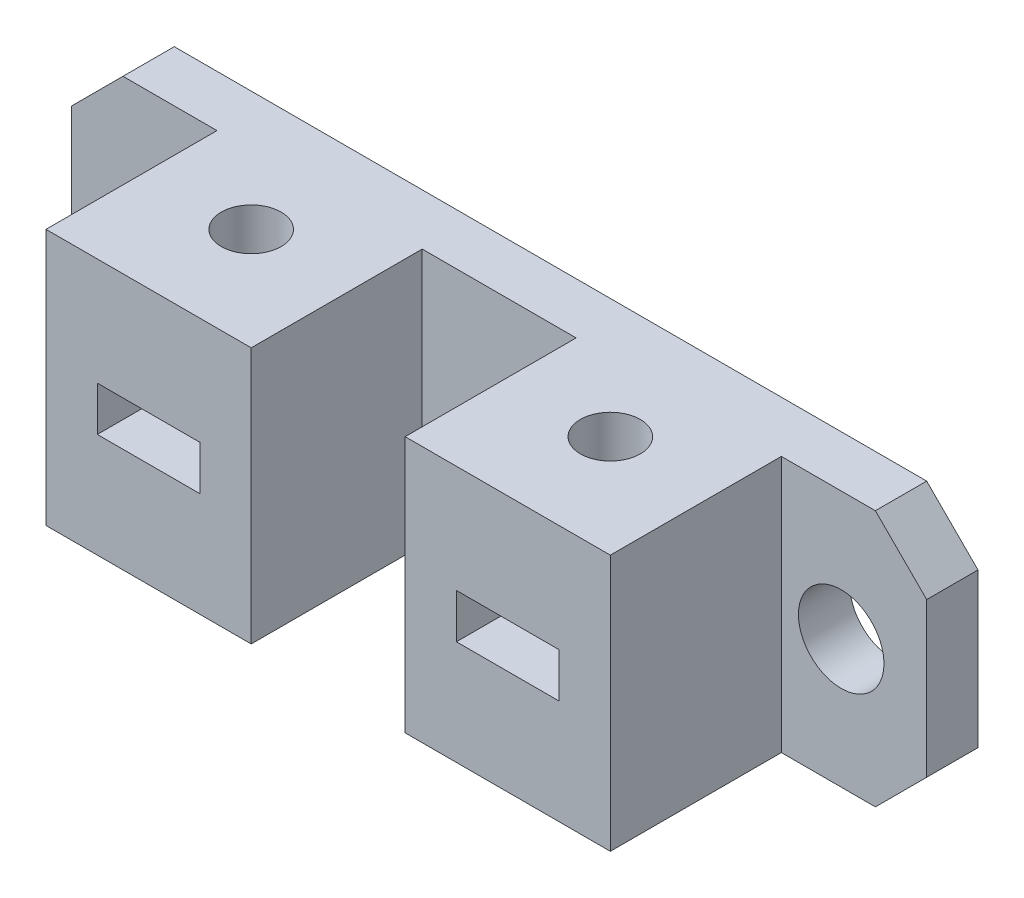
ISO-10303-21;
HEADER;
FILE_DESCRIPTION(('STEP AP214'),'2;1');
FILE_NAME('part.step','',(''),(''),'','','');
FILE_SCHEMA(('AUTOMOTIVE_DESIGN { 1 0 10303 214 1 1 1 1 }'));
ENDSEC;
DATA;
#1=APPLICATION_CONTEXT('core data for automotive mechanical design processes');
#2=APPLICATION_PROTOCOL_DEFINITION('international standard','automotive_design',2000,#1);
#3=PRODUCT_CONTEXT('',#1,'mechanical');
#4=PRODUCT('Part','Part','',(#3));
#5=PRODUCT_RELATED_PRODUCT_CATEGORY('part','',(#4));
#6=PRODUCT_DEFINITION_FORMATION('','',#4);
#7=PRODUCT_DEFINITION_CONTEXT('part definition',#1,'design');
#8=PRODUCT_DEFINITION('design','',#6,#7);
#9=PRODUCT_DEFINITION_SHAPE('','',#8);
#10=(LENGTH_UNIT() NAMED_UNIT(*) SI_UNIT(.MILLI.,.METRE.));
#11=(NAMED_UNIT(*) PLANE_ANGLE_UNIT() SI_UNIT($,.RADIAN.));
#12=(NAMED_UNIT(*) SI_UNIT($,.STERADIAN.) SOLID_ANGLE_UNIT());
#13=UNCERTAINTY_MEASURE_WITH_UNIT(LENGTH_MEASURE(1.E-05),#10,'distance_accuracy_value','');
#14=(GEOMETRIC_REPRESENTATION_CONTEXT(3) GLOBAL_UNCERTAINTY_ASSIGNED_CONTEXT((#13)) GLOBAL_UNIT_ASSIGNED_CONTEXT((#10,
#11,#12)) REPRESENTATION_CONTEXT('',''));
#15=CARTESIAN_POINT('',(0.,0.,0.));
#16=DIRECTION('',(0.,0.,1.));
#17=DIRECTION('',(1.,0.,0.));
#18=AXIS2_PLACEMENT_3D('',#15,#16,#17);
#19=CARTESIAN_POINT('',(0.,15.,3.));
#20=DIRECTION('',(0.,0.,-1.));
#21=DIRECTION('',(-1.,0.,0.));
#22=AXIS2_PLACEMENT_3D('',#19,#20,#21);
#23=PLANE('',#22);
#24=DIRECTION('',(0.,-1.,0.));
#25=VECTOR('',#24,1.);
#26=CARTESIAN_POINT('',(29.5,15.,3.));
#27=LINE('',#26,#25);
#28=CARTESIAN_POINT('',(29.5,15.,3.));
#29=VERTEX_POINT('',#28);
#30=CARTESIAN_POINT('',(29.5,0.,3.));
#31=VERTEX_POINT('',#30);
#32=EDGE_CURVE('E212',#29,#31,#27,.T.);
#33=ORIENTED_EDGE('',*,*,#32,.F.);
#34=DIRECTION('',(-1.,0.,0.));
#35=VECTOR('',#34,1.);
#36=CARTESIAN_POINT('',(0.,15.,3.));
#37=LINE('',#36,#35);
#38=CARTESIAN_POINT('',(20.5,15.,3.));
#39=VERTEX_POINT('',#38);
#40=EDGE_CURVE('E321',#29,#39,#37,.T.);
#41=ORIENTED_EDGE('',*,*,#40,.T.);
#42=DIRECTION('',(0.,1.,0.));
#43=VECTOR('',#42,1.);
#44=CARTESIAN_POINT('',(20.5,15.,3.));
#45=LINE('',#44,#43);
#46=CARTESIAN_POINT('',(20.5,0.,3.));
#47=VERTEX_POINT('',#46);
#48=EDGE_CURVE('E299',#47,#39,#45,.T.);
#49=ORIENTED_EDGE('',*,*,#48,.F.);
#50=DIRECTION('',(1.,0.,0.));
#51=VECTOR('',#50,1.);
#52=CARTESIAN_POINT('',(0.,0.,3.));
#53=LINE('',#52,#51);
#54=EDGE_CURVE('E369',#47,#31,#53,.T.);
#55=ORIENTED_EDGE('',*,*,#54,.T.);
#56=EDGE_LOOP('',(#33,#41,#49,#55));
#57=FACE_BOUND('',#56,.T.);
#58=ADVANCED_FACE('F32',(#57),#23,.F.);
#59=CARTESIAN_POINT('',(45.,7.5,3.));
#60=DIRECTION('',(0.,0.,1.));
#61=DIRECTION('',(-1.,0.,0.));
#62=AXIS2_PLACEMENT_3D('',#59,#60,#61);
#63=CIRCLE('',#62,2.5);
#64=CARTESIAN_POINT('',(42.5,7.5,3.));
#65=VERTEX_POINT('',#64);
#66=EDGE_CURVE('E400',#65,#65,#63,.T.);
#67=ORIENTED_EDGE('',*,*,#66,.F.);
#68=EDGE_LOOP('',(#67));
#69=FACE_BOUND('',#68,.T.);
#70=DIRECTION('',(0.,1.,0.));
#71=VECTOR('',#70,1.);
#72=CARTESIAN_POINT('',(50.,0.,3.));
#73=LINE('',#72,#71);
#74=CARTESIAN_POINT('',(50.,3.00000000000001,3.));
#75=VERTEX_POINT('',#74);
#76=CARTESIAN_POINT('',(50.,12.,3.));
#77=VERTEX_POINT('',#76);
#78=EDGE_CURVE('E332',#75,#77,#73,.T.);
#79=ORIENTED_EDGE('',*,*,#78,.T.);
#80=DIRECTION('',(0.707106781186546,-0.707106781186549,0.));
#81=VECTOR('',#80,1.);
#82=CARTESIAN_POINT('',(47.,15.,3.));
#83=LINE('',#82,#81);
#84=CARTESIAN_POINT('',(47.,15.,3.));
#85=VERTEX_POINT('',#84);
#86=EDGE_CURVE('E364',#77,#85,#83,.F.);
#87=ORIENTED_EDGE('',*,*,#86,.T.);
#88=CARTESIAN_POINT('',(41.5,15.,3.));
#89=VERTEX_POINT('',#88);
#90=EDGE_CURVE('E324',#85,#89,#37,.T.);
#91=ORIENTED_EDGE('',*,*,#90,.T.);
#92=DIRECTION('',(0.,1.,0.));
#93=VECTOR('',#92,1.);
#94=CARTESIAN_POINT('',(41.5,15.,3.));
#95=LINE('',#94,#93);
#96=CARTESIAN_POINT('',(41.5,0.,3.));
#97=VERTEX_POINT('',#96);
#98=EDGE_CURVE('E242',#97,#89,#95,.T.);
#99=ORIENTED_EDGE('',*,*,#98,.F.);
#100=CARTESIAN_POINT('',(47.,0.,3.));
#101=VERTEX_POINT('',#100);
#102=EDGE_CURVE('E326',#97,#101,#53,.T.);
#103=ORIENTED_EDGE('',*,*,#102,.T.);
#104=DIRECTION('',(-0.707106781186548,-0.707106781186547,0.));
#105=VECTOR('',#104,1.);
#106=CARTESIAN_POINT('',(50.,3.00000000000001,3.));
#107=LINE('',#106,#105);
#108=EDGE_CURVE('E362',#101,#75,#107,.F.);
#109=ORIENTED_EDGE('',*,*,#108,.T.);
#110=EDGE_LOOP('',(#79,#87,#91,#99,#103,#109));
#111=FACE_BOUND('',#110,.T.);
#112=ADVANCED_FACE('F416',(#69,#111),#23,.F.);
#113=CARTESIAN_POINT('',(5.,7.5,3.));
#114=DIRECTION('',(0.,0.,1.));
#115=DIRECTION('',(1.,0.,0.));
#116=AXIS2_PLACEMENT_3D('',#113,#114,#115);
#117=CIRCLE('',#116,2.5);
#118=CARTESIAN_POINT('',(7.5,7.5,3.));
#119=VERTEX_POINT('',#118);
#120=EDGE_CURVE('E393',#119,#119,#117,.T.);
#121=ORIENTED_EDGE('',*,*,#120,.F.);
#122=EDGE_LOOP('',(#121));
#123=FACE_BOUND('',#122,.T.);
#124=DIRECTION('',(0.,-1.,0.));
#125=VECTOR('',#124,1.);
#126=CARTESIAN_POINT('',(0.,0.,3.));
#127=LINE('',#126,#125);
#128=CARTESIAN_POINT('',(0.,12.,3.));
#129=VERTEX_POINT('',#128);
#130=CARTESIAN_POINT('',(0.,3.00000000000002,3.));
#131=VERTEX_POINT('',#130);
#132=EDGE_CURVE('E373',#129,#131,#127,.T.);
#133=ORIENTED_EDGE('',*,*,#132,.T.);
#134=DIRECTION('',(-0.707106781186547,0.707106781186548,0.));
#135=VECTOR('',#134,1.);
#136=CARTESIAN_POINT('',(3.00000000000001,0.,3.));
#137=LINE('',#136,#135);
#138=CARTESIAN_POINT('',(3.00000000000001,0.,3.));
#139=VERTEX_POINT('',#138);
#140=EDGE_CURVE('E11',#131,#139,#137,.F.);
#141=ORIENTED_EDGE('',*,*,#140,.T.);
#142=CARTESIAN_POINT('',(8.5,0.,3.));
#143=VERTEX_POINT('',#142);
#144=EDGE_CURVE('E367',#139,#143,#53,.T.);
#145=ORIENTED_EDGE('',*,*,#144,.T.);
#146=DIRECTION('',(0.,-1.,0.));
#147=VECTOR('',#146,1.);
#148=CARTESIAN_POINT('',(8.5,15.,3.));
#149=LINE('',#148,#147);
#150=CARTESIAN_POINT('',(8.5,15.,3.));
#151=VERTEX_POINT('',#150);
#152=EDGE_CURVE('E294',#151,#143,#149,.T.);
#153=ORIENTED_EDGE('',*,*,#152,.F.);
#154=CARTESIAN_POINT('',(3.00000000000001,15.,3.));
#155=VERTEX_POINT('',#154);
#156=EDGE_CURVE('E325',#151,#155,#37,.T.);
#157=ORIENTED_EDGE('',*,*,#156,.T.);
#158=DIRECTION('',(0.707106781186548,0.707106781186547,0.));
#159=VECTOR('',#158,1.);
#160=CARTESIAN_POINT('',(0.,12.,3.));
#161=LINE('',#160,#159);
#162=EDGE_CURVE('E40',#155,#129,#161,.F.);
#163=ORIENTED_EDGE('',*,*,#162,.T.);
#164=EDGE_LOOP('',(#133,#141,#145,#153,#157,#163));
#165=FACE_BOUND('',#164,.T.);
#166=ADVANCED_FACE('F419',(#123,#165),#23,.F.);
#167=CARTESIAN_POINT('',(0.,0.,3.));
#168=DIRECTION('',(1.,0.,0.));
#169=DIRECTION('',(0.,0.,-1.));
#170=AXIS2_PLACEMENT_3D('',#167,#168,#169);
#171=PLANE('',#170);
#172=DIRECTION('',(0.,-1.,0.));
#173=VECTOR('',#172,1.);
#174=CARTESIAN_POINT('',(0.,0.,0.));
#175=LINE('',#174,#173);
#176=CARTESIAN_POINT('',(0.,12.,0.));
#177=VERTEX_POINT('',#176);
#178=CARTESIAN_POINT('',(0.,3.00000000000002,0.));
#179=VERTEX_POINT('',#178);
#180=EDGE_CURVE('E333',#177,#179,#175,.T.);
#181=ORIENTED_EDGE('',*,*,#180,.T.);
#182=DIRECTION('',(0.,0.,1.));
#183=VECTOR('',#182,1.);
#184=CARTESIAN_POINT('',(0.,3.00000000000002,3.));
#185=LINE('',#184,#183);
#186=EDGE_CURVE('E47',#179,#131,#185,.T.);
#187=ORIENTED_EDGE('',*,*,#186,.T.);
#188=ORIENTED_EDGE('',*,*,#132,.F.);
#189=DIRECTION('',(0.,0.,-1.));
#190=VECTOR('',#189,1.);
#191=CARTESIAN_POINT('',(0.,12.,3.));
#192=LINE('',#191,#190);
#193=EDGE_CURVE('E441',#129,#177,#192,.T.);
#194=ORIENTED_EDGE('',*,*,#193,.T.);
#195=EDGE_LOOP('',(#181,#187,#188,#194));
#196=FACE_BOUND('',#195,.T.);
#197=ADVANCED_FACE('F442',(#196),#171,.F.);
#198=CARTESIAN_POINT('',(0.,0.,3.));
#199=DIRECTION('',(0.,1.,0.));
#200=DIRECTION('',(0.,0.,1.));
#201=AXIS2_PLACEMENT_3D('',#198,#199,#200);
#202=PLANE('',#201);
#203=CARTESIAN_POINT('',(14.5,0.,7.00000000000001));
#204=DIRECTION('',(0.,1.,0.));
#205=DIRECTION('',(0.,0.,1.));
#206=AXIS2_PLACEMENT_3D('',#203,#204,#205);
#207=CIRCLE('',#206,1.75);
#208=CARTESIAN_POINT('',(14.5,0.,8.75000000000001));
#209=VERTEX_POINT('',#208);
#210=EDGE_CURVE('E764',#209,#209,#207,.T.);
#211=ORIENTED_EDGE('',*,*,#210,.T.);
#212=EDGE_LOOP('',(#211));
#213=FACE_BOUND('',#212,.T.);
#214=CARTESIAN_POINT('',(35.5,0.,7.));
#215=DIRECTION('',(0.,1.,0.));
#216=DIRECTION('',(0.,0.,1.));
#217=AXIS2_PLACEMENT_3D('',#214,#215,#216);
#218=CIRCLE('',#217,1.75);
#219=CARTESIAN_POINT('',(35.5,0.,8.75000000000001));
#220=VERTEX_POINT('',#219);
#221=EDGE_CURVE('E227',#220,#220,#218,.T.);
#222=ORIENTED_EDGE('',*,*,#221,.T.);
#223=EDGE_LOOP('',(#222));
#224=FACE_BOUND('',#223,.T.);
#225=DIRECTION('',(1.,0.,0.));
#226=VECTOR('',#225,1.);
#227=CARTESIAN_POINT('',(0.,0.,0.));
#228=LINE('',#227,#226);
#229=CARTESIAN_POINT('',(3.00000000000001,0.,0.));
#230=VERTEX_POINT('',#229);
#231=CARTESIAN_POINT('',(47.,0.,0.));
#232=VERTEX_POINT('',#231);
#233=EDGE_CURVE('E383',#230,#232,#228,.T.);
#234=ORIENTED_EDGE('',*,*,#233,.T.);
#235=DIRECTION('',(0.,0.,1.));
#236=VECTOR('',#235,1.);
#237=CARTESIAN_POINT('',(47.,0.,3.));
#238=LINE('',#237,#236);
#239=EDGE_CURVE('E443',#232,#101,#238,.T.);
#240=ORIENTED_EDGE('',*,*,#239,.T.);
#241=ORIENTED_EDGE('',*,*,#102,.F.);
#242=DIRECTION('',(0.,0.,-1.));
#243=VECTOR('',#242,1.);
#244=CARTESIAN_POINT('',(41.5,0.,13.));
#245=LINE('',#244,#243);
#246=CARTESIAN_POINT('',(41.5,0.,13.));
#247=VERTEX_POINT('',#246);
#248=EDGE_CURVE('E255',#247,#97,#245,.T.);
#249=ORIENTED_EDGE('',*,*,#248,.F.);
#250=DIRECTION('',(1.,0.,0.));
#251=VECTOR('',#250,1.);
#252=CARTESIAN_POINT('',(41.5,0.,13.));
#253=LINE('',#252,#251);
#254=CARTESIAN_POINT('',(29.5,0.,13.));
#255=VERTEX_POINT('',#254);
#256=EDGE_CURVE('E244',#255,#247,#253,.T.);
#257=ORIENTED_EDGE('',*,*,#256,.F.);
#258=DIRECTION('',(0.,0.,-1.));
#259=VECTOR('',#258,1.);
#260=CARTESIAN_POINT('',(29.5,0.,13.));
#261=LINE('',#260,#259);
#262=EDGE_CURVE('E258',#255,#31,#261,.T.);
#263=ORIENTED_EDGE('',*,*,#262,.T.);
#264=ORIENTED_EDGE('',*,*,#54,.F.);
#265=DIRECTION('',(0.,0.,-1.));
#266=VECTOR('',#265,1.);
#267=CARTESIAN_POINT('',(20.5,0.,13.));
#268=LINE('',#267,#266);
#269=CARTESIAN_POINT('',(20.5,0.,13.));
#270=VERTEX_POINT('',#269);
#271=EDGE_CURVE('E832',#270,#47,#268,.T.);
#272=ORIENTED_EDGE('',*,*,#271,.F.);
#273=DIRECTION('',(1.,0.,0.));
#274=VECTOR('',#273,1.);
#275=CARTESIAN_POINT('',(8.5,0.,13.));
#276=LINE('',#275,#274);
#277=CARTESIAN_POINT('',(8.5,0.,13.));
#278=VERTEX_POINT('',#277);
#279=EDGE_CURVE('E298',#278,#270,#276,.T.);
#280=ORIENTED_EDGE('',*,*,#279,.F.);
#281=DIRECTION('',(0.,0.,-1.));
#282=VECTOR('',#281,1.);
#283=CARTESIAN_POINT('',(8.5,0.,13.));
#284=LINE('',#283,#282);
#285=EDGE_CURVE('E402',#278,#143,#284,.T.);
#286=ORIENTED_EDGE('',*,*,#285,.T.);
#287=ORIENTED_EDGE('',*,*,#144,.F.);
#288=DIRECTION('',(0.,0.,-1.));
#289=VECTOR('',#288,1.);
#290=CARTESIAN_POINT('',(3.00000000000001,0.,3.));
#291=LINE('',#290,#289);
#292=EDGE_CURVE('E366',#139,#230,#291,.T.);
#293=ORIENTED_EDGE('',*,*,#292,.T.);
#294=EDGE_LOOP('',(#234,#240,#241,#249,#257,#263,#264,#272,#280,#286,#287,#293));
#295=FACE_BOUND('',#294,.T.);
#296=ADVANCED_FACE('F449',(#213,#224,#295),#202,.F.);
#297=CARTESIAN_POINT('',(50.,0.,3.));
#298=DIRECTION('',(-1.,0.,0.));
#299=DIRECTION('',(0.,0.,1.));
#300=AXIS2_PLACEMENT_3D('',#297,#298,#299);
#301=PLANE('',#300);
#302=DIRECTION('',(0.,1.,0.));
#303=VECTOR('',#302,1.);
#304=CARTESIAN_POINT('',(50.,0.,0.));
#305=LINE('',#304,#303);
#306=CARTESIAN_POINT('',(50.,3.00000000000001,0.));
#307=VERTEX_POINT('',#306);
#308=CARTESIAN_POINT('',(50.,12.,0.));
#309=VERTEX_POINT('',#308);
#310=EDGE_CURVE('E381',#307,#309,#305,.T.);
#311=ORIENTED_EDGE('',*,*,#310,.T.);
#312=DIRECTION('',(0.,0.,1.));
#313=VECTOR('',#312,1.);
#314=CARTESIAN_POINT('',(50.,12.,3.));
#315=LINE('',#314,#313);
#316=EDGE_CURVE('E360',#309,#77,#315,.T.);
#317=ORIENTED_EDGE('',*,*,#316,.T.);
#318=ORIENTED_EDGE('',*,*,#78,.F.);
#319=DIRECTION('',(0.,0.,-1.));
#320=VECTOR('',#319,1.);
#321=CARTESIAN_POINT('',(50.,3.00000000000001,3.));
#322=LINE('',#321,#320);
#323=EDGE_CURVE('E357',#75,#307,#322,.T.);
#324=ORIENTED_EDGE('',*,*,#323,.T.);
#325=EDGE_LOOP('',(#311,#317,#318,#324));
#326=FACE_BOUND('',#325,.T.);
#327=ADVANCED_FACE('F455',(#326),#301,.F.);
#328=CARTESIAN_POINT('',(0.,15.,3.));
#329=DIRECTION('',(0.,-1.,0.));
#330=DIRECTION('',(0.,0.,-1.));
#331=AXIS2_PLACEMENT_3D('',#328,#329,#330);
#332=PLANE('',#331);
#333=CARTESIAN_POINT('',(14.5,15.,7.00000000000001));
#334=DIRECTION('',(0.,1.,0.));
#335=DIRECTION('',(0.,0.,-1.));
#336=AXIS2_PLACEMENT_3D('',#333,#334,#335);
#337=CIRCLE('',#336,1.75);
#338=CARTESIAN_POINT('',(14.5,15.,5.25000000000001));
#339=VERTEX_POINT('',#338);
#340=EDGE_CURVE('E777',#339,#339,#337,.T.);
#341=ORIENTED_EDGE('',*,*,#340,.F.);
#342=EDGE_LOOP('',(#341));
#343=FACE_BOUND('',#342,.T.);
#344=CARTESIAN_POINT('',(35.5,15.,7.));
#345=DIRECTION('',(0.,1.,0.));
#346=DIRECTION('',(0.,0.,1.));
#347=AXIS2_PLACEMENT_3D('',#344,#345,#346);
#348=CIRCLE('',#347,1.75);
#349=CARTESIAN_POINT('',(35.5,15.,8.75000000000001));
#350=VERTEX_POINT('',#349);
#351=EDGE_CURVE('E761',#350,#350,#348,.T.);
#352=ORIENTED_EDGE('',*,*,#351,.F.);
#353=EDGE_LOOP('',(#352));
#354=FACE_BOUND('',#353,.T.);
#355=ORIENTED_EDGE('',*,*,#90,.F.);
#356=DIRECTION('',(0.,0.,-1.));
#357=VECTOR('',#356,1.);
#358=CARTESIAN_POINT('',(47.,15.,3.));
#359=LINE('',#358,#357);
#360=CARTESIAN_POINT('',(47.,15.,0.));
#361=VERTEX_POINT('',#360);
#362=EDGE_CURVE('E346',#85,#361,#359,.T.);
#363=ORIENTED_EDGE('',*,*,#362,.T.);
#364=DIRECTION('',(-1.,0.,0.));
#365=VECTOR('',#364,1.);
#366=CARTESIAN_POINT('',(0.,15.,0.));
#367=LINE('',#366,#365);
#368=CARTESIAN_POINT('',(3.00000000000001,15.,0.));
#369=VERTEX_POINT('',#368);
#370=EDGE_CURVE('E378',#361,#369,#367,.T.);
#371=ORIENTED_EDGE('',*,*,#370,.T.);
#372=DIRECTION('',(0.,0.,1.));
#373=VECTOR('',#372,1.);
#374=CARTESIAN_POINT('',(3.00000000000001,15.,3.));
#375=LINE('',#374,#373);
#376=EDGE_CURVE('E343',#369,#155,#375,.T.);
#377=ORIENTED_EDGE('',*,*,#376,.T.);
#378=ORIENTED_EDGE('',*,*,#156,.F.);
#379=DIRECTION('',(0.,0.,-1.));
#380=VECTOR('',#379,1.);
#381=CARTESIAN_POINT('',(8.5,15.,13.));
#382=LINE('',#381,#380);
#383=CARTESIAN_POINT('',(8.5,15.,13.));
#384=VERTEX_POINT('',#383);
#385=EDGE_CURVE('E305',#384,#151,#382,.T.);
#386=ORIENTED_EDGE('',*,*,#385,.F.);
#387=DIRECTION('',(-1.,0.,0.));
#388=VECTOR('',#387,1.);
#389=CARTESIAN_POINT('',(8.5,15.,13.));
#390=LINE('',#389,#388);
#391=CARTESIAN_POINT('',(20.5,15.,13.));
#392=VERTEX_POINT('',#391);
#393=EDGE_CURVE('E303',#392,#384,#390,.T.);
#394=ORIENTED_EDGE('',*,*,#393,.F.);
#395=DIRECTION('',(0.,0.,-1.));
#396=VECTOR('',#395,1.);
#397=CARTESIAN_POINT('',(20.5,15.,13.));
#398=LINE('',#397,#396);
#399=EDGE_CURVE('E318',#392,#39,#398,.T.);
#400=ORIENTED_EDGE('',*,*,#399,.T.);
#401=ORIENTED_EDGE('',*,*,#40,.F.);
#402=DIRECTION('',(0.,0.,-1.));
#403=VECTOR('',#402,1.);
#404=CARTESIAN_POINT('',(29.5,15.,13.));
#405=LINE('',#404,#403);
#406=CARTESIAN_POINT('',(29.5,15.,13.));
#407=VERTEX_POINT('',#406);
#408=EDGE_CURVE('E261',#407,#29,#405,.T.);
#409=ORIENTED_EDGE('',*,*,#408,.F.);
#410=DIRECTION('',(-1.,0.,0.));
#411=VECTOR('',#410,1.);
#412=CARTESIAN_POINT('',(41.5,15.,13.));
#413=LINE('',#412,#411);
#414=CARTESIAN_POINT('',(41.5,15.,13.));
#415=VERTEX_POINT('',#414);
#416=EDGE_CURVE('E238',#415,#407,#413,.T.);
#417=ORIENTED_EDGE('',*,*,#416,.F.);
#418=DIRECTION('',(0.,0.,-1.));
#419=VECTOR('',#418,1.);
#420=CARTESIAN_POINT('',(41.5,15.,13.));
#421=LINE('',#420,#419);
#422=EDGE_CURVE('E248',#415,#89,#421,.T.);
#423=ORIENTED_EDGE('',*,*,#422,.T.);
#424=EDGE_LOOP('',(#355,#363,#371,#377,#378,#386,#394,#400,#401,#409,#417,#423));
#425=FACE_BOUND('',#424,.T.);
#426=ADVANCED_FACE('F435',(#343,#354,#425),#332,.F.);
#427=CARTESIAN_POINT('',(0.,15.,0.));
#428=DIRECTION('',(0.,0.,-1.));
#429=DIRECTION('',(-1.,0.,0.));
#430=AXIS2_PLACEMENT_3D('',#427,#428,#429);
#431=PLANE('',#430);
#432=CARTESIAN_POINT('',(45.,7.5,0.));
#433=DIRECTION('',(0.,0.,1.));
#434=DIRECTION('',(-1.,0.,0.));
#435=AXIS2_PLACEMENT_3D('',#432,#433,#434);
#436=CIRCLE('',#435,2.5);
#437=CARTESIAN_POINT('',(42.5,7.5,0.));
#438=VERTEX_POINT('',#437);
#439=EDGE_CURVE('E398',#438,#438,#436,.T.);
#440=ORIENTED_EDGE('',*,*,#439,.T.);
#441=EDGE_LOOP('',(#440));
#442=FACE_BOUND('',#441,.T.);
#443=CARTESIAN_POINT('',(5.,7.5,0.));
#444=DIRECTION('',(0.,0.,1.));
#445=DIRECTION('',(1.,0.,0.));
#446=AXIS2_PLACEMENT_3D('',#443,#444,#445);
#447=CIRCLE('',#446,2.5);
#448=CARTESIAN_POINT('',(7.5,7.5,0.));
#449=VERTEX_POINT('',#448);
#450=EDGE_CURVE('E389',#449,#449,#447,.T.);
#451=ORIENTED_EDGE('',*,*,#450,.T.);
#452=EDGE_LOOP('',(#451));
#453=FACE_BOUND('',#452,.T.);
#454=ORIENTED_EDGE('',*,*,#370,.F.);
#455=DIRECTION('',(-0.707106781186546,0.707106781186549,0.));
#456=VECTOR('',#455,1.);
#457=CARTESIAN_POINT('',(23.5000000000001,38.5,0.));
#458=LINE('',#457,#456);
#459=EDGE_CURVE('E355',#361,#309,#458,.F.);
#460=ORIENTED_EDGE('',*,*,#459,.T.);
#461=ORIENTED_EDGE('',*,*,#310,.F.);
#462=DIRECTION('',(0.707106781186548,0.707106781186547,0.));
#463=VECTOR('',#462,1.);
#464=CARTESIAN_POINT('',(30.9999999999999,-16.,0.));
#465=LINE('',#464,#463);
#466=EDGE_CURVE('E353',#307,#232,#465,.F.);
#467=ORIENTED_EDGE('',*,*,#466,.T.);
#468=ORIENTED_EDGE('',*,*,#233,.F.);
#469=DIRECTION('',(0.707106781186547,-0.707106781186548,0.));
#470=VECTOR('',#469,1.);
#471=CARTESIAN_POINT('',(-5.99999999999999,9.00000000000002,0.));
#472=LINE('',#471,#470);
#473=EDGE_CURVE('E351',#230,#179,#472,.F.);
#474=ORIENTED_EDGE('',*,*,#473,.T.);
#475=ORIENTED_EDGE('',*,*,#180,.F.);
#476=DIRECTION('',(-0.707106781186548,-0.707106781186547,0.));
#477=VECTOR('',#476,1.);
#478=CARTESIAN_POINT('',(1.5,13.5,0.));
#479=LINE('',#478,#477);
#480=EDGE_CURVE('E349',#177,#369,#479,.F.);
#481=ORIENTED_EDGE('',*,*,#480,.T.);
#482=EDGE_LOOP('',(#454,#460,#461,#467,#468,#474,#475,#481));
#483=FACE_BOUND('',#482,.T.);
#484=ADVANCED_FACE('F406',(#442,#453,#483),#431,.T.);
#485=CARTESIAN_POINT('',(5.,7.5,0.));
#486=DIRECTION('',(0.,0.,1.));
#487=DIRECTION('',(1.,0.,0.));
#488=AXIS2_PLACEMENT_3D('',#485,#486,#487);
#489=CYLINDRICAL_SURFACE('',#488,2.5);
#490=ORIENTED_EDGE('',*,*,#450,.F.);
#491=EDGE_LOOP('',(#490));
#492=FACE_BOUND('',#491,.T.);
#493=ORIENTED_EDGE('',*,*,#120,.T.);
#494=EDGE_LOOP('',(#493));
#495=FACE_BOUND('',#494,.T.);
#496=ADVANCED_FACE('F412',(#492,#495),#489,.F.);
#497=CARTESIAN_POINT('',(45.,7.5,0.));
#498=DIRECTION('',(0.,0.,1.));
#499=DIRECTION('',(1.,0.,0.));
#500=AXIS2_PLACEMENT_3D('',#497,#498,#499);
#501=CYLINDRICAL_SURFACE('',#500,2.5);
#502=ORIENTED_EDGE('',*,*,#439,.F.);
#503=EDGE_LOOP('',(#502));
#504=FACE_BOUND('',#503,.T.);
#505=ORIENTED_EDGE('',*,*,#66,.T.);
#506=EDGE_LOOP('',(#505));
#507=FACE_BOUND('',#506,.T.);
#508=ADVANCED_FACE('F408',(#504,#507),#501,.F.);
#509=CARTESIAN_POINT('',(8.5,0.,13.));
#510=DIRECTION('',(0.,0.,1.));
#511=DIRECTION('',(1.,0.,0.));
#512=AXIS2_PLACEMENT_3D('',#509,#510,#511);
#513=PLANE('',#512);
#514=DIRECTION('',(0.,-1.,0.));
#515=VECTOR('',#514,1.);
#516=CARTESIAN_POINT('',(8.5,15.,13.));
#517=LINE('',#516,#515);
#518=EDGE_CURVE('E295',#384,#278,#517,.T.);
#519=ORIENTED_EDGE('',*,*,#518,.T.);
#520=ORIENTED_EDGE('',*,*,#279,.T.);
#521=DIRECTION('',(0.,1.,0.));
#522=VECTOR('',#521,1.);
#523=CARTESIAN_POINT('',(20.5,15.,13.));
#524=LINE('',#523,#522);
#525=EDGE_CURVE('E301',#270,#392,#524,.T.);
#526=ORIENTED_EDGE('',*,*,#525,.T.);
#527=ORIENTED_EDGE('',*,*,#393,.T.);
#528=EDGE_LOOP('',(#519,#520,#526,#527));
#529=FACE_BOUND('',#528,.T.);
#530=DIRECTION('',(1.,0.,0.));
#531=VECTOR('',#530,1.);
#532=CARTESIAN_POINT('',(11.5,6.11259468506965,13.));
#533=LINE('',#532,#531);
#534=CARTESIAN_POINT('',(11.5,6.11259468506965,13.));
#535=VERTEX_POINT('',#534);
#536=CARTESIAN_POINT('',(17.5,6.11259468506965,13.));
#537=VERTEX_POINT('',#536);
#538=EDGE_CURVE('E267',#535,#537,#533,.T.);
#539=ORIENTED_EDGE('',*,*,#538,.F.);
#540=DIRECTION('',(0.,-1.,0.));
#541=VECTOR('',#540,1.);
#542=CARTESIAN_POINT('',(11.5,8.71259468506965,13.));
#543=LINE('',#542,#541);
#544=CARTESIAN_POINT('',(11.5,8.71259468506965,13.));
#545=VERTEX_POINT('',#544);
#546=EDGE_CURVE('E265',#545,#535,#543,.T.);
#547=ORIENTED_EDGE('',*,*,#546,.F.);
#548=DIRECTION('',(-1.,0.,0.));
#549=VECTOR('',#548,1.);
#550=CARTESIAN_POINT('',(11.5,8.71259468506965,13.));
#551=LINE('',#550,#549);
#552=CARTESIAN_POINT('',(17.5,8.71259468506965,13.));
#553=VERTEX_POINT('',#552);
#554=EDGE_CURVE('E273',#553,#545,#551,.T.);
#555=ORIENTED_EDGE('',*,*,#554,.F.);
#556=DIRECTION('',(0.,1.,0.));
#557=VECTOR('',#556,1.);
#558=CARTESIAN_POINT('',(17.5,8.71259468506965,13.));
#559=LINE('',#558,#557);
#560=EDGE_CURVE('E270',#537,#553,#559,.T.);
#561=ORIENTED_EDGE('',*,*,#560,.F.);
#562=EDGE_LOOP('',(#539,#547,#555,#561));
#563=FACE_BOUND('',#562,.T.);
#564=ADVANCED_FACE('F411',(#529,#563),#513,.T.);
#565=CARTESIAN_POINT('',(8.5,15.,13.));
#566=DIRECTION('',(1.,0.,0.));
#567=DIRECTION('',(0.,1.,0.));
#568=AXIS2_PLACEMENT_3D('',#565,#566,#567);
#569=PLANE('',#568);
#570=ORIENTED_EDGE('',*,*,#152,.T.);
#571=ORIENTED_EDGE('',*,*,#285,.F.);
#572=ORIENTED_EDGE('',*,*,#518,.F.);
#573=ORIENTED_EDGE('',*,*,#385,.T.);
#574=EDGE_LOOP('',(#570,#571,#572,#573));
#575=FACE_BOUND('',#574,.T.);
#576=ADVANCED_FACE('F561',(#575),#569,.F.);
#577=CARTESIAN_POINT('',(20.5,15.,13.));
#578=DIRECTION('',(-1.,0.,0.));
#579=DIRECTION('',(0.,-1.,0.));
#580=AXIS2_PLACEMENT_3D('',#577,#578,#579);
#581=PLANE('',#580);
#582=ORIENTED_EDGE('',*,*,#48,.T.);
#583=ORIENTED_EDGE('',*,*,#399,.F.);
#584=ORIENTED_EDGE('',*,*,#525,.F.);
#585=ORIENTED_EDGE('',*,*,#271,.T.);
#586=EDGE_LOOP('',(#582,#583,#584,#585));
#587=FACE_BOUND('',#586,.T.);
#588=ADVANCED_FACE('F557',(#587),#581,.F.);
#589=CARTESIAN_POINT('',(11.5,8.71259468506965,13.));
#590=DIRECTION('',(1.,0.,0.));
#591=DIRECTION('',(0.,0.,-1.));
#592=AXIS2_PLACEMENT_3D('',#589,#590,#591);
#593=PLANE('',#592);
#594=DIRECTION('',(0.,-1.,0.));
#595=VECTOR('',#594,1.);
#596=CARTESIAN_POINT('',(11.5,8.71259468506965,3.));
#597=LINE('',#596,#595);
#598=CARTESIAN_POINT('',(11.5,8.71259468506965,3.));
#599=VERTEX_POINT('',#598);
#600=CARTESIAN_POINT('',(11.5,6.11259468506965,3.));
#601=VERTEX_POINT('',#600);
#602=EDGE_CURVE('E264',#599,#601,#597,.T.);
#603=ORIENTED_EDGE('',*,*,#602,.F.);
#604=DIRECTION('',(0.,0.,-1.));
#605=VECTOR('',#604,1.);
#606=CARTESIAN_POINT('',(11.5,8.71259468506965,13.));
#607=LINE('',#606,#605);
#608=EDGE_CURVE('E275',#545,#599,#607,.T.);
#609=ORIENTED_EDGE('',*,*,#608,.F.);
#610=ORIENTED_EDGE('',*,*,#546,.T.);
#611=DIRECTION('',(0.,0.,-1.));
#612=VECTOR('',#611,1.);
#613=CARTESIAN_POINT('',(11.5,6.11259468506965,13.));
#614=LINE('',#613,#612);
#615=EDGE_CURVE('E291',#535,#601,#614,.T.);
#616=ORIENTED_EDGE('',*,*,#615,.T.);
#617=EDGE_LOOP('',(#603,#609,#610,#616));
#618=FACE_BOUND('',#617,.T.);
#619=ADVANCED_FACE('F553',(#618),#593,.T.);
#620=CARTESIAN_POINT('',(11.5,6.11259468506965,13.));
#621=DIRECTION('',(0.,1.,0.));
#622=DIRECTION('',(0.,0.,1.));
#623=AXIS2_PLACEMENT_3D('',#620,#621,#622);
#624=PLANE('',#623);
#625=CARTESIAN_POINT('',(14.5,6.11259468506965,7.00000000000001));
#626=DIRECTION('',(0.,1.,0.));
#627=DIRECTION('',(0.,0.,1.));
#628=AXIS2_PLACEMENT_3D('',#625,#626,#627);
#629=CIRCLE('',#628,1.75);
#630=CARTESIAN_POINT('',(14.5,6.11259468506965,8.75000000000001));
#631=VERTEX_POINT('',#630);
#632=EDGE_CURVE('E768',#631,#631,#629,.T.);
#633=ORIENTED_EDGE('',*,*,#632,.F.);
#634=EDGE_LOOP('',(#633));
#635=FACE_BOUND('',#634,.T.);
#636=DIRECTION('',(1.,0.,0.));
#637=VECTOR('',#636,1.);
#638=CARTESIAN_POINT('',(11.5,6.11259468506965,3.));
#639=LINE('',#638,#637);
#640=CARTESIAN_POINT('',(17.5,6.11259468506965,3.));
#641=VERTEX_POINT('',#640);
#642=EDGE_CURVE('E278',#601,#641,#639,.T.);
#643=ORIENTED_EDGE('',*,*,#642,.F.);
#644=ORIENTED_EDGE('',*,*,#615,.F.);
#645=ORIENTED_EDGE('',*,*,#538,.T.);
#646=DIRECTION('',(0.,0.,-1.));
#647=VECTOR('',#646,1.);
#648=CARTESIAN_POINT('',(17.5,6.11259468506965,13.));
#649=LINE('',#648,#647);
#650=EDGE_CURVE('E289',#537,#641,#649,.T.);
#651=ORIENTED_EDGE('',*,*,#650,.T.);
#652=EDGE_LOOP('',(#643,#644,#645,#651));
#653=FACE_BOUND('',#652,.T.);
#654=ADVANCED_FACE('F549',(#635,#653),#624,.T.);
#655=CARTESIAN_POINT('',(17.5,8.71259468506965,13.));
#656=DIRECTION('',(-1.,0.,0.));
#657=DIRECTION('',(0.,0.,1.));
#658=AXIS2_PLACEMENT_3D('',#655,#656,#657);
#659=PLANE('',#658);
#660=DIRECTION('',(0.,1.,0.));
#661=VECTOR('',#660,1.);
#662=CARTESIAN_POINT('',(17.5,8.71259468506965,3.));
#663=LINE('',#662,#661);
#664=CARTESIAN_POINT('',(17.5,8.71259468506965,3.));
#665=VERTEX_POINT('',#664);
#666=EDGE_CURVE('E281',#641,#665,#663,.T.);
#667=ORIENTED_EDGE('',*,*,#666,.F.);
#668=ORIENTED_EDGE('',*,*,#650,.F.);
#669=ORIENTED_EDGE('',*,*,#560,.T.);
#670=DIRECTION('',(0.,0.,-1.));
#671=VECTOR('',#670,1.);
#672=CARTESIAN_POINT('',(17.5,8.71259468506965,13.));
#673=LINE('',#672,#671);
#674=EDGE_CURVE('E287',#553,#665,#673,.T.);
#675=ORIENTED_EDGE('',*,*,#674,.T.);
#676=EDGE_LOOP('',(#667,#668,#669,#675));
#677=FACE_BOUND('',#676,.T.);
#678=ADVANCED_FACE('F485',(#677),#659,.T.);
#679=CARTESIAN_POINT('',(11.5,8.71259468506965,13.));
#680=DIRECTION('',(0.,-1.,0.));
#681=DIRECTION('',(0.,0.,-1.));
#682=AXIS2_PLACEMENT_3D('',#679,#680,#681);
#683=PLANE('',#682);
#684=CARTESIAN_POINT('',(14.5,8.71259468506965,7.00000000000001));
#685=DIRECTION('',(0.,-1.,0.));
#686=DIRECTION('',(0.,0.,-1.));
#687=AXIS2_PLACEMENT_3D('',#684,#685,#686);
#688=CIRCLE('',#687,1.75);
#689=CARTESIAN_POINT('',(14.5,8.71259468506965,5.25000000000001));
#690=VERTEX_POINT('',#689);
#691=EDGE_CURVE('E344',#690,#690,#688,.T.);
#692=ORIENTED_EDGE('',*,*,#691,.F.);
#693=EDGE_LOOP('',(#692));
#694=FACE_BOUND('',#693,.T.);
#695=DIRECTION('',(-1.,0.,0.));
#696=VECTOR('',#695,1.);
#697=CARTESIAN_POINT('',(11.5,8.71259468506965,3.));
#698=LINE('',#697,#696);
#699=EDGE_CURVE('E268',#665,#599,#698,.T.);
#700=ORIENTED_EDGE('',*,*,#699,.F.);
#701=ORIENTED_EDGE('',*,*,#674,.F.);
#702=ORIENTED_EDGE('',*,*,#554,.T.);
#703=ORIENTED_EDGE('',*,*,#608,.T.);
#704=EDGE_LOOP('',(#700,#701,#702,#703));
#705=FACE_BOUND('',#704,.T.);
#706=ADVANCED_FACE('F475',(#694,#705),#683,.T.);
#707=ORIENTED_EDGE('',*,*,#699,.T.);
#708=ORIENTED_EDGE('',*,*,#602,.T.);
#709=ORIENTED_EDGE('',*,*,#642,.T.);
#710=ORIENTED_EDGE('',*,*,#666,.T.);
#711=EDGE_LOOP('',(#707,#708,#709,#710));
#712=FACE_BOUND('',#711,.T.);
#713=ADVANCED_FACE('F468',(#712),#23,.F.);
#714=CARTESIAN_POINT('',(29.5,15.,13.));
#715=DIRECTION('',(0.,0.,1.));
#716=DIRECTION('',(1.,0.,0.));
#717=AXIS2_PLACEMENT_3D('',#714,#715,#716);
#718=PLANE('',#717);
#719=ORIENTED_EDGE('',*,*,#416,.T.);
#720=DIRECTION('',(0.,-1.,0.));
#721=VECTOR('',#720,1.);
#722=CARTESIAN_POINT('',(29.5,15.,13.));
#723=LINE('',#722,#721);
#724=EDGE_CURVE('E241',#407,#255,#723,.T.);
#725=ORIENTED_EDGE('',*,*,#724,.T.);
#726=ORIENTED_EDGE('',*,*,#256,.T.);
#727=DIRECTION('',(0.,1.,0.));
#728=VECTOR('',#727,1.);
#729=CARTESIAN_POINT('',(41.5,15.,13.));
#730=LINE('',#729,#728);
#731=EDGE_CURVE('E246',#247,#415,#730,.T.);
#732=ORIENTED_EDGE('',*,*,#731,.T.);
#733=EDGE_LOOP('',(#719,#725,#726,#732));
#734=FACE_BOUND('',#733,.T.);
#735=DIRECTION('',(0.,-1.,0.));
#736=VECTOR('',#735,1.);
#737=CARTESIAN_POINT('',(32.5,8.71259468506965,13.));
#738=LINE('',#737,#736);
#739=CARTESIAN_POINT('',(32.5,8.71259468506965,13.));
#740=VERTEX_POINT('',#739);
#741=CARTESIAN_POINT('',(32.5,6.11259468506965,13.));
#742=VERTEX_POINT('',#741);
#743=EDGE_CURVE('E204',#740,#742,#738,.T.);
#744=ORIENTED_EDGE('',*,*,#743,.F.);
#745=DIRECTION('',(-1.,0.,0.));
#746=VECTOR('',#745,1.);
#747=CARTESIAN_POINT('',(38.5,8.71259468506966,13.));
#748=LINE('',#747,#746);
#749=CARTESIAN_POINT('',(38.5,8.71259468506966,13.));
#750=VERTEX_POINT('',#749);
#751=EDGE_CURVE('E194',#750,#740,#748,.T.);
#752=ORIENTED_EDGE('',*,*,#751,.F.);
#753=DIRECTION('',(0.,1.,0.));
#754=VECTOR('',#753,1.);
#755=CARTESIAN_POINT('',(38.5,8.71259468506966,13.));
#756=LINE('',#755,#754);
#757=CARTESIAN_POINT('',(38.5,6.11259468506966,13.));
#758=VERTEX_POINT('',#757);
#759=EDGE_CURVE('E220',#758,#750,#756,.T.);
#760=ORIENTED_EDGE('',*,*,#759,.F.);
#761=DIRECTION('',(1.,0.,0.));
#762=VECTOR('',#761,1.);
#763=CARTESIAN_POINT('',(38.5,6.11259468506966,13.));
#764=LINE('',#763,#762);
#765=EDGE_CURVE('E218',#742,#758,#764,.T.);
#766=ORIENTED_EDGE('',*,*,#765,.F.);
#767=EDGE_LOOP('',(#744,#752,#760,#766));
#768=FACE_BOUND('',#767,.T.);
#769=ADVANCED_FACE('F216',(#734,#768),#718,.T.);
#770=CARTESIAN_POINT('',(29.5,15.,13.));
#771=DIRECTION('',(1.,0.,0.));
#772=DIRECTION('',(0.,0.,-1.));
#773=AXIS2_PLACEMENT_3D('',#770,#771,#772);
#774=PLANE('',#773);
#775=ORIENTED_EDGE('',*,*,#32,.T.);
#776=ORIENTED_EDGE('',*,*,#262,.F.);
#777=ORIENTED_EDGE('',*,*,#724,.F.);
#778=ORIENTED_EDGE('',*,*,#408,.T.);
#779=EDGE_LOOP('',(#775,#776,#777,#778));
#780=FACE_BOUND('',#779,.T.);
#781=ADVANCED_FACE('F482',(#780),#774,.F.);
#782=CARTESIAN_POINT('',(41.5,15.,13.));
#783=DIRECTION('',(-1.,0.,0.));
#784=DIRECTION('',(0.,-1.,0.));
#785=AXIS2_PLACEMENT_3D('',#782,#783,#784);
#786=PLANE('',#785);
#787=ORIENTED_EDGE('',*,*,#98,.T.);
#788=ORIENTED_EDGE('',*,*,#422,.F.);
#789=ORIENTED_EDGE('',*,*,#731,.F.);
#790=ORIENTED_EDGE('',*,*,#248,.T.);
#791=EDGE_LOOP('',(#787,#788,#789,#790));
#792=FACE_BOUND('',#791,.T.);
#793=ADVANCED_FACE('F538',(#792),#786,.F.);
#794=CARTESIAN_POINT('',(38.5,8.71259468506966,13.));
#795=DIRECTION('',(0.,-1.,0.));
#796=DIRECTION('',(1.,0.,0.));
#797=AXIS2_PLACEMENT_3D('',#794,#795,#796);
#798=PLANE('',#797);
#799=CARTESIAN_POINT('',(35.5,8.71259468506966,7.));
#800=DIRECTION('',(0.,-1.,0.));
#801=DIRECTION('',(1.,0.,0.));
#802=AXIS2_PLACEMENT_3D('',#799,#800,#801);
#803=CIRCLE('',#802,1.75);
#804=CARTESIAN_POINT('',(37.25,8.71259468506966,7.));
#805=VERTEX_POINT('',#804);
#806=EDGE_CURVE('E758',#805,#805,#803,.T.);
#807=ORIENTED_EDGE('',*,*,#806,.F.);
#808=EDGE_LOOP('',(#807));
#809=FACE_BOUND('',#808,.T.);
#810=DIRECTION('',(-1.,0.,0.));
#811=VECTOR('',#810,1.);
#812=CARTESIAN_POINT('',(38.5,8.71259468506966,3.));
#813=LINE('',#812,#811);
#814=CARTESIAN_POINT('',(38.5,8.71259468506966,3.));
#815=VERTEX_POINT('',#814);
#816=CARTESIAN_POINT('',(32.5,8.71259468506965,3.));
#817=VERTEX_POINT('',#816);
#818=EDGE_CURVE('E225',#815,#817,#813,.T.);
#819=ORIENTED_EDGE('',*,*,#818,.F.);
#820=DIRECTION('',(0.,0.,-1.));
#821=VECTOR('',#820,1.);
#822=CARTESIAN_POINT('',(38.5,8.71259468506966,13.));
#823=LINE('',#822,#821);
#824=EDGE_CURVE('E200',#750,#815,#823,.T.);
#825=ORIENTED_EDGE('',*,*,#824,.F.);
#826=ORIENTED_EDGE('',*,*,#751,.T.);
#827=DIRECTION('',(0.,0.,-1.));
#828=VECTOR('',#827,1.);
#829=CARTESIAN_POINT('',(32.5,8.71259468506965,13.));
#830=LINE('',#829,#828);
#831=EDGE_CURVE('E198',#740,#817,#830,.T.);
#832=ORIENTED_EDGE('',*,*,#831,.T.);
#833=EDGE_LOOP('',(#819,#825,#826,#832));
#834=FACE_BOUND('',#833,.T.);
#835=ADVANCED_FACE('F197',(#809,#834),#798,.T.);
#836=CARTESIAN_POINT('',(32.5,8.71259468506965,13.));
#837=DIRECTION('',(1.,0.,0.));
#838=DIRECTION('',(0.,0.,-1.));
#839=AXIS2_PLACEMENT_3D('',#836,#837,#838);
#840=PLANE('',#839);
#841=DIRECTION('',(0.,-1.,0.));
#842=VECTOR('',#841,1.);
#843=CARTESIAN_POINT('',(32.5,8.71259468506965,3.));
#844=LINE('',#843,#842);
#845=CARTESIAN_POINT('',(32.5,6.11259468506965,3.));
#846=VERTEX_POINT('',#845);
#847=EDGE_CURVE('E211',#817,#846,#844,.T.);
#848=ORIENTED_EDGE('',*,*,#847,.F.);
#849=ORIENTED_EDGE('',*,*,#831,.F.);
#850=ORIENTED_EDGE('',*,*,#743,.T.);
#851=DIRECTION('',(0.,0.,-1.));
#852=VECTOR('',#851,1.);
#853=CARTESIAN_POINT('',(32.5,6.11259468506965,13.));
#854=LINE('',#853,#852);
#855=EDGE_CURVE('E213',#742,#846,#854,.T.);
#856=ORIENTED_EDGE('',*,*,#855,.T.);
#857=EDGE_LOOP('',(#848,#849,#850,#856));
#858=FACE_BOUND('',#857,.T.);
#859=ADVANCED_FACE('F208',(#858),#840,.T.);
#860=CARTESIAN_POINT('',(38.5,6.11259468506966,13.));
#861=DIRECTION('',(0.,1.,0.));
#862=DIRECTION('',(-1.,0.,0.));
#863=AXIS2_PLACEMENT_3D('',#860,#861,#862);
#864=PLANE('',#863);
#865=CARTESIAN_POINT('',(35.5,6.11259468506966,7.));
#866=DIRECTION('',(0.,1.,0.));
#867=DIRECTION('',(-1.,0.,0.));
#868=AXIS2_PLACEMENT_3D('',#865,#866,#867);
#869=CIRCLE('',#868,1.75);
#870=CARTESIAN_POINT('',(33.75,6.11259468506965,7.));
#871=VERTEX_POINT('',#870);
#872=EDGE_CURVE('E763',#871,#871,#869,.T.);
#873=ORIENTED_EDGE('',*,*,#872,.F.);
#874=EDGE_LOOP('',(#873));
#875=FACE_BOUND('',#874,.T.);
#876=DIRECTION('',(1.,0.,0.));
#877=VECTOR('',#876,1.);
#878=CARTESIAN_POINT('',(38.5,6.11259468506966,3.));
#879=LINE('',#878,#877);
#880=CARTESIAN_POINT('',(38.5,6.11259468506966,3.));
#881=VERTEX_POINT('',#880);
#882=EDGE_CURVE('E229',#846,#881,#879,.T.);
#883=ORIENTED_EDGE('',*,*,#882,.F.);
#884=ORIENTED_EDGE('',*,*,#855,.F.);
#885=ORIENTED_EDGE('',*,*,#765,.T.);
#886=DIRECTION('',(0.,0.,-1.));
#887=VECTOR('',#886,1.);
#888=CARTESIAN_POINT('',(38.5,6.11259468506966,13.));
#889=LINE('',#888,#887);
#890=EDGE_CURVE('E235',#758,#881,#889,.T.);
#891=ORIENTED_EDGE('',*,*,#890,.T.);
#892=EDGE_LOOP('',(#883,#884,#885,#891));
#893=FACE_BOUND('',#892,.T.);
#894=ADVANCED_FACE('F499',(#875,#893),#864,.T.);
#895=CARTESIAN_POINT('',(38.5,8.71259468506966,13.));
#896=DIRECTION('',(-1.,0.,0.));
#897=DIRECTION('',(0.,0.,1.));
#898=AXIS2_PLACEMENT_3D('',#895,#896,#897);
#899=PLANE('',#898);
#900=DIRECTION('',(0.,1.,0.));
#901=VECTOR('',#900,1.);
#902=CARTESIAN_POINT('',(38.5,8.71259468506966,3.));
#903=LINE('',#902,#901);
#904=EDGE_CURVE('E205',#881,#815,#903,.T.);
#905=ORIENTED_EDGE('',*,*,#904,.F.);
#906=ORIENTED_EDGE('',*,*,#890,.F.);
#907=ORIENTED_EDGE('',*,*,#759,.T.);
#908=ORIENTED_EDGE('',*,*,#824,.T.);
#909=EDGE_LOOP('',(#905,#906,#907,#908));
#910=FACE_BOUND('',#909,.T.);
#911=ADVANCED_FACE('F490',(#910),#899,.T.);
#912=ORIENTED_EDGE('',*,*,#904,.T.);
#913=ORIENTED_EDGE('',*,*,#818,.T.);
#914=ORIENTED_EDGE('',*,*,#847,.T.);
#915=ORIENTED_EDGE('',*,*,#882,.T.);
#916=EDGE_LOOP('',(#912,#913,#914,#915));
#917=FACE_BOUND('',#916,.T.);
#918=ADVANCED_FACE('F477',(#917),#23,.F.);
#919=CARTESIAN_POINT('',(35.5,-4.99999999997031E-05,7.));
#920=DIRECTION('',(0.,1.,0.));
#921=DIRECTION('',(0.,0.,1.));
#922=AXIS2_PLACEMENT_3D('',#919,#920,#921);
#923=CYLINDRICAL_SURFACE('',#922,1.75);
#924=ORIENTED_EDGE('',*,*,#872,.T.);
#925=EDGE_LOOP('',(#924));
#926=FACE_BOUND('',#925,.T.);
#927=ORIENTED_EDGE('',*,*,#221,.F.);
#928=EDGE_LOOP('',(#927));
#929=FACE_BOUND('',#928,.T.);
#930=ADVANCED_FACE('F489',(#926,#929),#923,.F.);
#931=ORIENTED_EDGE('',*,*,#806,.T.);
#932=EDGE_LOOP('',(#931));
#933=FACE_BOUND('',#932,.T.);
#934=ORIENTED_EDGE('',*,*,#351,.T.);
#935=EDGE_LOOP('',(#934));
#936=FACE_BOUND('',#935,.T.);
#937=ADVANCED_FACE('F496',(#933,#936),#923,.F.);
#938=CARTESIAN_POINT('',(14.5,-4.99999999997031E-05,7.00000000000001));
#939=DIRECTION('',(0.,1.,0.));
#940=DIRECTION('',(0.,0.,1.));
#941=AXIS2_PLACEMENT_3D('',#938,#939,#940);
#942=CYLINDRICAL_SURFACE('',#941,1.75);
#943=ORIENTED_EDGE('',*,*,#691,.T.);
#944=EDGE_LOOP('',(#943));
#945=FACE_BOUND('',#944,.T.);
#946=ORIENTED_EDGE('',*,*,#340,.T.);
#947=EDGE_LOOP('',(#946));
#948=FACE_BOUND('',#947,.T.);
#949=ADVANCED_FACE('F522',(#945,#948),#942,.F.);
#950=ORIENTED_EDGE('',*,*,#632,.T.);
#951=EDGE_LOOP('',(#950));
#952=FACE_BOUND('',#951,.T.);
#953=ORIENTED_EDGE('',*,*,#210,.F.);
#954=EDGE_LOOP('',(#953));
#955=FACE_BOUND('',#954,.T.);
#956=ADVANCED_FACE('F518',(#952,#955),#942,.F.);
#957=CARTESIAN_POINT('',(47.,15.,3.));
#958=DIRECTION('',(-0.707106781186549,-0.707106781186546,0.));
#959=DIRECTION('',(0.707106781186546,-0.707106781186549,0.));
#960=AXIS2_PLACEMENT_3D('',#957,#958,#959);
#961=PLANE('',#960);
#962=ORIENTED_EDGE('',*,*,#86,.F.);
#963=ORIENTED_EDGE('',*,*,#316,.F.);
#964=ORIENTED_EDGE('',*,*,#459,.F.);
#965=ORIENTED_EDGE('',*,*,#362,.F.);
#966=EDGE_LOOP('',(#962,#963,#964,#965));
#967=FACE_BOUND('',#966,.T.);
#968=ADVANCED_FACE('F432',(#967),#961,.F.);
#969=CARTESIAN_POINT('',(50.,3.00000000000001,3.));
#970=DIRECTION('',(-0.707106781186547,0.707106781186548,0.));
#971=DIRECTION('',(-0.707106781186548,-0.707106781186547,0.));
#972=AXIS2_PLACEMENT_3D('',#969,#970,#971);
#973=PLANE('',#972);
#974=ORIENTED_EDGE('',*,*,#108,.F.);
#975=ORIENTED_EDGE('',*,*,#239,.F.);
#976=ORIENTED_EDGE('',*,*,#466,.F.);
#977=ORIENTED_EDGE('',*,*,#323,.F.);
#978=EDGE_LOOP('',(#974,#975,#976,#977));
#979=FACE_BOUND('',#978,.T.);
#980=ADVANCED_FACE('F454',(#979),#973,.F.);
#981=CARTESIAN_POINT('',(3.00000000000001,0.,3.));
#982=DIRECTION('',(0.707106781186548,0.707106781186547,0.));
#983=DIRECTION('',(-0.707106781186547,0.707106781186548,0.));
#984=AXIS2_PLACEMENT_3D('',#981,#982,#983);
#985=PLANE('',#984);
#986=ORIENTED_EDGE('',*,*,#140,.F.);
#987=ORIENTED_EDGE('',*,*,#186,.F.);
#988=ORIENTED_EDGE('',*,*,#473,.F.);
#989=ORIENTED_EDGE('',*,*,#292,.F.);
#990=EDGE_LOOP('',(#986,#987,#988,#989));
#991=FACE_BOUND('',#990,.T.);
#992=ADVANCED_FACE('F509',(#991),#985,.F.);
#993=CARTESIAN_POINT('',(0.,12.,3.));
#994=DIRECTION('',(0.707106781186547,-0.707106781186548,0.));
#995=DIRECTION('',(0.707106781186548,0.707106781186547,0.));
#996=AXIS2_PLACEMENT_3D('',#993,#994,#995);
#997=PLANE('',#996);
#998=ORIENTED_EDGE('',*,*,#162,.F.);
#999=ORIENTED_EDGE('',*,*,#376,.F.);
#1000=ORIENTED_EDGE('',*,*,#480,.F.);
#1001=ORIENTED_EDGE('',*,*,#193,.F.);
#1002=EDGE_LOOP('',(#998,#999,#1000,#1001));
#1003=FACE_BOUND('',#1002,.T.);
#1004=ADVANCED_FACE('F34',(#1003),#997,.F.);
#1005=CLOSED_SHELL('',(#58,#112,#166,#197,#296,#327,#426,#484,#496,#508,#564,#576,#588,#619,
#654,#678,#706,#713,#769,#781,#793,#835,#859,#894,#911,#918,#930,#937,#949,#956,#968,#980,#992,#1004));
#1006=MANIFOLD_SOLID_BREP('B2',#1005);
#1007=ADVANCED_BREP_SHAPE_REPRESENTATION('',(#18,#1006),#14);
#1008=SHAPE_DEFINITION_REPRESENTATION(#9,#1007);
ENDSEC;
END-ISO-10303-21;
